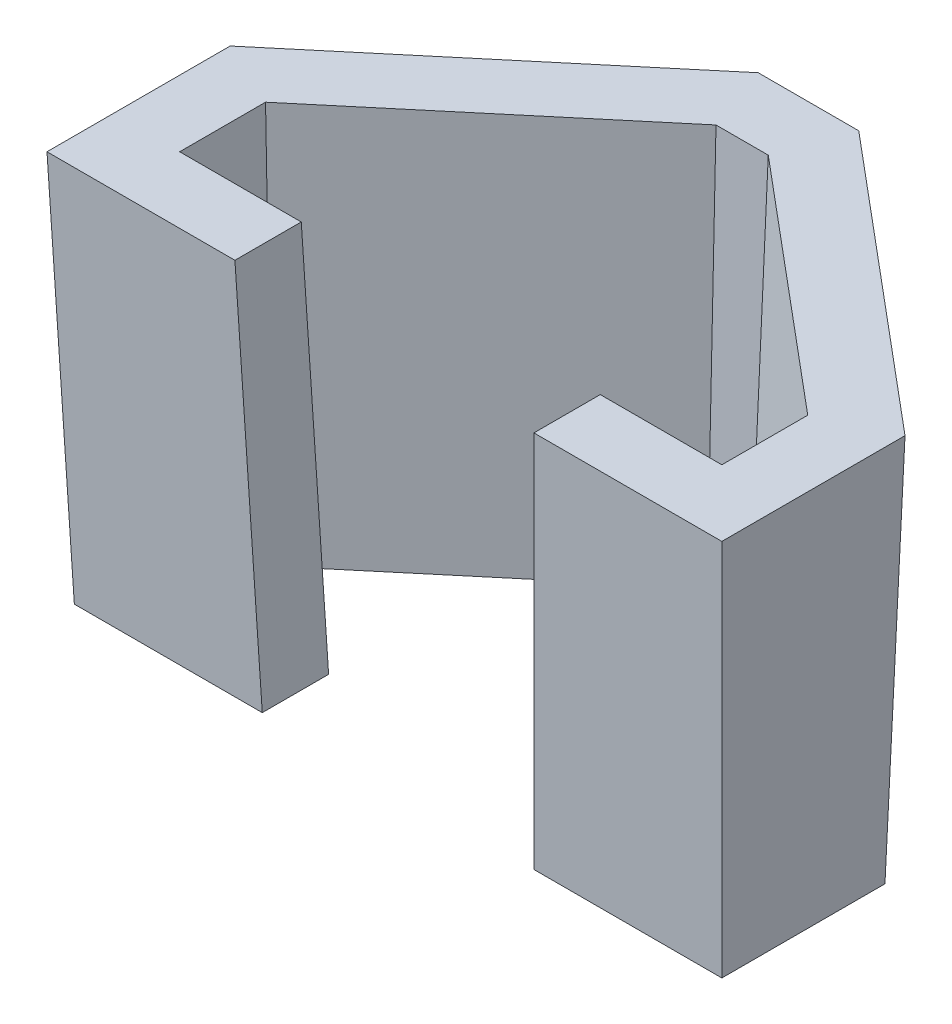
ISO-10303-21;
HEADER;
FILE_DESCRIPTION(('STEP AP214'),'2;1');
FILE_NAME('part.step','',(''),(''),'','','');
FILE_SCHEMA(('AUTOMOTIVE_DESIGN { 1 0 10303 214 1 1 1 1 }'));
ENDSEC;
DATA;
#1=APPLICATION_CONTEXT('core data for automotive mechanical design processes');
#2=APPLICATION_PROTOCOL_DEFINITION('international standard','automotive_design',2000,#1);
#3=PRODUCT_CONTEXT('',#1,'mechanical');
#4=PRODUCT('Part','Part','',(#3));
#5=PRODUCT_RELATED_PRODUCT_CATEGORY('part','',(#4));
#6=PRODUCT_DEFINITION_FORMATION('','',#4);
#7=PRODUCT_DEFINITION_CONTEXT('part definition',#1,'design');
#8=PRODUCT_DEFINITION('design','',#6,#7);
#9=PRODUCT_DEFINITION_SHAPE('','',#8);
#10=(LENGTH_UNIT() NAMED_UNIT(*) SI_UNIT(.MILLI.,.METRE.));
#11=(NAMED_UNIT(*) PLANE_ANGLE_UNIT() SI_UNIT($,.RADIAN.));
#12=(NAMED_UNIT(*) SI_UNIT($,.STERADIAN.) SOLID_ANGLE_UNIT());
#13=UNCERTAINTY_MEASURE_WITH_UNIT(LENGTH_MEASURE(1.E-05),#10,'distance_accuracy_value','');
#14=(GEOMETRIC_REPRESENTATION_CONTEXT(3) GLOBAL_UNCERTAINTY_ASSIGNED_CONTEXT((#13)) GLOBAL_UNIT_ASSIGNED_CONTEXT((#10,
#11,#12)) REPRESENTATION_CONTEXT('',''));
#15=CARTESIAN_POINT('',(0.,0.,0.));
#16=DIRECTION('',(0.,0.,1.));
#17=DIRECTION('',(1.,0.,0.));
#18=AXIS2_PLACEMENT_3D('',#15,#16,#17);
#19=CARTESIAN_POINT('',(111.25,0.,12.7));
#20=DIRECTION('',(0.,-0.034899496702501,0.999390827019096));
#21=DIRECTION('',(0.,-0.999390827019096,-0.034899496702501));
#22=AXIS2_PLACEMENT_3D('',#19,#20,#21);
#23=PLANE('',#22);
#24=DIRECTION('',(-0.0348782627423747,-0.998782765958718,-0.0348782627423747));
#25=VECTOR('',#24,1.);
#26=CARTESIAN_POINT('',(75.2595505362086,-0.442414758217532,12.6845505362085));
#27=LINE('',#26,#25);
#28=CARTESIAN_POINT('',(77.8940577118811,75.,15.3190577118811));
#29=VERTEX_POINT('',#28);
#30=CARTESIAN_POINT('',(75.275,0.,12.7));
#31=VERTEX_POINT('',#30);
#32=EDGE_CURVE('E161',#29,#31,#27,.T.);
#33=ORIENTED_EDGE('',*,*,#32,.T.);
#34=DIRECTION('',(-1.,0.,0.));
#35=VECTOR('',#34,1.);
#36=CARTESIAN_POINT('',(111.25,0.,12.7));
#37=LINE('',#36,#35);
#38=CARTESIAN_POINT('',(111.25,0.,12.7));
#39=VERTEX_POINT('',#38);
#40=EDGE_CURVE('E171',#39,#31,#37,.T.);
#41=ORIENTED_EDGE('',*,*,#40,.F.);
#42=DIRECTION('',(-0.0348782627423747,-0.998782765958718,-0.0348782627423747));
#43=VECTOR('',#42,1.);
#44=CARTESIAN_POINT('',(111.212017180763,-1.08768563205724,12.6620171807634));
#45=LINE('',#44,#43);
#46=CARTESIAN_POINT('',(113.869057711881,75.,15.3190577118811));
#47=VERTEX_POINT('',#46);
#48=EDGE_CURVE('E211',#47,#39,#45,.T.);
#49=ORIENTED_EDGE('',*,*,#48,.F.);
#50=DIRECTION('',(-1.,0.,0.));
#51=VECTOR('',#50,1.);
#52=CARTESIAN_POINT('',(0.,75.,15.3190577118811));
#53=LINE('',#52,#51);
#54=EDGE_CURVE('E174',#47,#29,#53,.T.);
#55=ORIENTED_EDGE('',*,*,#54,.T.);
#56=EDGE_LOOP('',(#33,#41,#49,#55));
#57=FACE_BOUND('',#56,.T.);
#58=ADVANCED_FACE('F47',(#57),#23,.T.);
#59=CARTESIAN_POINT('',(98.55,0.,0.));
#60=DIRECTION('',(0.,-0.034899496702501,0.999390827019096));
#61=DIRECTION('',(0.,-0.999390827019096,-0.0348994967025011));
#62=AXIS2_PLACEMENT_3D('',#59,#60,#61);
#63=PLANE('',#62);
#64=DIRECTION('',(-1.,0.,0.));
#65=VECTOR('',#64,1.);
#66=CARTESIAN_POINT('',(98.55,0.,0.));
#67=LINE('',#66,#65);
#68=CARTESIAN_POINT('',(98.55,0.,0.));
#69=VERTEX_POINT('',#68);
#70=CARTESIAN_POINT('',(75.275,0.,0.));
#71=VERTEX_POINT('',#70);
#72=EDGE_CURVE('E268',#69,#71,#67,.T.);
#73=ORIENTED_EDGE('',*,*,#72,.T.);
#74=DIRECTION('',(0.0348782627423747,0.998782765958718,0.0348782627423747));
#75=VECTOR('',#74,1.);
#76=CARTESIAN_POINT('',(75.3033138795076,0.810803425001026,0.0283138795075805));
#77=LINE('',#76,#75);
#78=CARTESIAN_POINT('',(77.8940577118811,75.,2.61905771188109));
#79=VERTEX_POINT('',#78);
#80=EDGE_CURVE('E11',#71,#79,#77,.T.);
#81=ORIENTED_EDGE('',*,*,#80,.T.);
#82=DIRECTION('',(-1.,0.,0.));
#83=VECTOR('',#82,1.);
#84=CARTESIAN_POINT('',(0.,75.,2.61905771188109));
#85=LINE('',#84,#83);
#86=CARTESIAN_POINT('',(101.169057711881,75.,2.61905771188109));
#87=VERTEX_POINT('',#86);
#88=EDGE_CURVE('E289',#87,#79,#85,.T.);
#89=ORIENTED_EDGE('',*,*,#88,.F.);
#90=DIRECTION('',(-0.0348782627423747,-0.998782765958718,-0.0348782627423747));
#91=VECTOR('',#90,1.);
#92=CARTESIAN_POINT('',(98.5346721855297,-0.438931177444165,-0.0153278144702715));
#93=LINE('',#92,#91);
#94=EDGE_CURVE('E283',#87,#69,#93,.T.);
#95=ORIENTED_EDGE('',*,*,#94,.T.);
#96=EDGE_LOOP('',(#73,#81,#89,#95));
#97=FACE_BOUND('',#96,.T.);
#98=ADVANCED_FACE('F347',(#97),#63,.F.);
#99=DIRECTION('',(0.0348782627423747,-0.998782765958718,-0.0348782627423747));
#100=VECTOR('',#99,1.);
#101=CARTESIAN_POINT('',(23.275,0.,12.7));
#102=LINE('',#101,#100);
#103=CARTESIAN_POINT('',(20.6559422881189,75.,15.3190577118811));
#104=VERTEX_POINT('',#103);
#105=CARTESIAN_POINT('',(23.275,0.,12.7));
#106=VERTEX_POINT('',#105);
#107=EDGE_CURVE('E176',#104,#106,#102,.T.);
#108=ORIENTED_EDGE('',*,*,#107,.F.);
#109=CARTESIAN_POINT('',(-15.3190577118811,75.,15.3190577118811));
#110=VERTEX_POINT('',#109);
#111=EDGE_CURVE('E210',#104,#110,#53,.T.);
#112=ORIENTED_EDGE('',*,*,#111,.T.);
#113=DIRECTION('',(0.0348782627423747,-0.998782765958718,-0.0348782627423747));
#114=VECTOR('',#113,1.);
#115=CARTESIAN_POINT('',(-12.5492156663818,-4.31789836858764,12.5492156663818));
#116=LINE('',#115,#114);
#117=CARTESIAN_POINT('',(-12.7,0.,12.7));
#118=VERTEX_POINT('',#117);
#119=EDGE_CURVE('E215',#110,#118,#116,.T.);
#120=ORIENTED_EDGE('',*,*,#119,.T.);
#121=EDGE_CURVE('E184',#106,#118,#37,.T.);
#122=ORIENTED_EDGE('',*,*,#121,.F.);
#123=EDGE_LOOP('',(#108,#112,#120,#122));
#124=FACE_BOUND('',#123,.T.);
#125=ADVANCED_FACE('F455',(#124),#23,.T.);
#126=CARTESIAN_POINT('',(111.25,0.,-18.5232068902524));
#127=DIRECTION('',(0.999390827019096,-0.034899496702501,0.));
#128=DIRECTION('',(0.0348994967025011,0.999390827019096,0.));
#129=AXIS2_PLACEMENT_3D('',#126,#127,#128);
#130=PLANE('',#129);
#131=DIRECTION('',(0.,0.,1.));
#132=VECTOR('',#131,1.);
#133=CARTESIAN_POINT('',(111.25,0.,-18.5232068902524));
#134=LINE('',#133,#132);
#135=CARTESIAN_POINT('',(111.25,0.,-18.5232068902524));
#136=VERTEX_POINT('',#135);
#137=EDGE_CURVE('E181',#136,#39,#134,.T.);
#138=ORIENTED_EDGE('',*,*,#137,.F.);
#139=DIRECTION('',(-0.0348948745148471,-0.999258464882715,0.0162747685953412));
#140=VECTOR('',#139,1.);
#141=CARTESIAN_POINT('',(111.210488163233,-1.13147096533441,-18.5047787970409));
#142=LINE('',#141,#140);
#143=CARTESIAN_POINT('',(113.869057711881,75.,-19.7447203300148));
#144=VERTEX_POINT('',#143);
#145=EDGE_CURVE('E214',#144,#136,#142,.T.);
#146=ORIENTED_EDGE('',*,*,#145,.F.);
#147=DIRECTION('',(0.,0.,1.));
#148=VECTOR('',#147,1.);
#149=CARTESIAN_POINT('',(113.869057711881,75.,0.));
#150=LINE('',#149,#148);
#151=EDGE_CURVE('E220',#144,#47,#150,.T.);
#152=ORIENTED_EDGE('',*,*,#151,.T.);
#153=ORIENTED_EDGE('',*,*,#48,.T.);
#154=EDGE_LOOP('',(#138,#146,#152,#153));
#155=FACE_BOUND('',#154,.T.);
#156=ADVANCED_FACE('F474',(#155),#130,.T.);
#157=CARTESIAN_POINT('',(57.9463991500488,0.,-63.2373203455384));
#158=DIRECTION('',(0.642287141369066,-0.034899496702501,-0.765669153852932));
#159=DIRECTION('',(-0.766135863120447,0.,-0.642678643834294));
#160=AXIS2_PLACEMENT_3D('',#157,#158,#159);
#161=PLANE('',#160);
#162=DIRECTION('',(0.766135863120447,0.,0.642678643834294));
#163=VECTOR('',#162,1.);
#164=CARTESIAN_POINT('',(57.9463991500488,0.,-63.2373203455384));
#165=LINE('',#164,#163);
#166=CARTESIAN_POINT('',(57.9463991500488,0.,-63.2373203455384));
#167=VERTEX_POINT('',#166);
#168=EDGE_CURVE('E205',#167,#136,#165,.T.);
#169=ORIENTED_EDGE('',*,*,#168,.F.);
#170=DIRECTION('',(-0.0126985433124823,-0.999310246384854,0.0348966827647472));
#171=VECTOR('',#170,1.);
#172=CARTESIAN_POINT('',(57.9436025717553,-0.220076372124338,-63.2296351092768));
#173=LINE('',#172,#171);
#174=CARTESIAN_POINT('',(58.899447266869,75.,-65.8563780574195));
#175=VERTEX_POINT('',#174);
#176=EDGE_CURVE('E226',#175,#167,#173,.T.);
#177=ORIENTED_EDGE('',*,*,#176,.F.);
#178=DIRECTION('',(0.766135863120447,0.,0.642678643834294));
#179=VECTOR('',#178,1.);
#180=CARTESIAN_POINT('',(56.7538905767994,75.,-67.6561938997784));
#181=LINE('',#180,#179);
#182=EDGE_CURVE('E237',#175,#144,#181,.T.);
#183=ORIENTED_EDGE('',*,*,#182,.T.);
#184=ORIENTED_EDGE('',*,*,#145,.T.);
#185=EDGE_LOOP('',(#169,#177,#183,#184));
#186=FACE_BOUND('',#185,.T.);
#187=ADVANCED_FACE('F471',(#186),#161,.T.);
#188=CARTESIAN_POINT('',(40.6036008499512,0.,-63.2373203455384));
#189=DIRECTION('',(0.,-0.034899496702501,-0.999390827019096));
#190=DIRECTION('',(0.,0.999390827019096,-0.034899496702501));
#191=AXIS2_PLACEMENT_3D('',#188,#189,#190);
#192=PLANE('',#191);
#193=DIRECTION('',(1.,0.,0.));
#194=VECTOR('',#193,1.);
#195=CARTESIAN_POINT('',(40.6036008499512,0.,-63.2373203455384));
#196=LINE('',#195,#194);
#197=CARTESIAN_POINT('',(40.6036008499512,0.,-63.2373203455384));
#198=VERTEX_POINT('',#197);
#199=EDGE_CURVE('E201',#198,#167,#196,.T.);
#200=ORIENTED_EDGE('',*,*,#199,.F.);
#201=DIRECTION('',(0.0126985433124823,-0.999310246384854,0.0348966827647472));
#202=VECTOR('',#201,1.);
#203=CARTESIAN_POINT('',(40.6148199640562,-0.882886753589432,-63.206489260729));
#204=LINE('',#203,#202);
#205=CARTESIAN_POINT('',(39.650552733131,75.,-65.8563780574195));
#206=VERTEX_POINT('',#205);
#207=EDGE_CURVE('E223',#206,#198,#204,.T.);
#208=ORIENTED_EDGE('',*,*,#207,.F.);
#209=DIRECTION('',(1.,0.,0.));
#210=VECTOR('',#209,1.);
#211=CARTESIAN_POINT('',(0.,75.,-65.8563780574194));
#212=LINE('',#211,#210);
#213=EDGE_CURVE('E241',#206,#175,#212,.T.);
#214=ORIENTED_EDGE('',*,*,#213,.T.);
#215=ORIENTED_EDGE('',*,*,#176,.T.);
#216=EDGE_LOOP('',(#200,#208,#214,#215));
#217=FACE_BOUND('',#216,.T.);
#218=ADVANCED_FACE('F469',(#217),#192,.T.);
#219=CARTESIAN_POINT('',(-12.7,0.,-18.5232068902524));
#220=DIRECTION('',(-0.642287141369066,-0.034899496702501,-0.765669153852932));
#221=DIRECTION('',(-0.766135863120447,0.,0.642678643834294));
#222=AXIS2_PLACEMENT_3D('',#219,#220,#221);
#223=PLANE('',#222);
#224=DIRECTION('',(0.766135863120447,0.,-0.642678643834294));
#225=VECTOR('',#224,1.);
#226=CARTESIAN_POINT('',(-12.7,0.,-18.5232068902524));
#227=LINE('',#226,#225);
#228=CARTESIAN_POINT('',(-12.7,0.,-18.5232068902524));
#229=VERTEX_POINT('',#228);
#230=EDGE_CURVE('E191',#229,#198,#227,.T.);
#231=ORIENTED_EDGE('',*,*,#230,.F.);
#232=DIRECTION('',(0.0348948745148471,-0.999258464882716,0.0162747685953412));
#233=VECTOR('',#232,1.);
#234=CARTESIAN_POINT('',(-12.6822681532213,-0.507773655527217,-18.5149368589912));
#235=LINE('',#234,#233);
#236=CARTESIAN_POINT('',(-15.3190577118811,75.,-19.7447203300148));
#237=VERTEX_POINT('',#236);
#238=EDGE_CURVE('E219',#237,#229,#235,.T.);
#239=ORIENTED_EDGE('',*,*,#238,.F.);
#240=DIRECTION('',(0.766135863120447,0.,-0.642678643834294));
#241=VECTOR('',#240,1.);
#242=CARTESIAN_POINT('',(-16.0492086196296,75.,-19.1322279278513));
#243=LINE('',#242,#241);
#244=EDGE_CURVE('E245',#237,#206,#243,.T.);
#245=ORIENTED_EDGE('',*,*,#244,.T.);
#246=ORIENTED_EDGE('',*,*,#207,.T.);
#247=EDGE_LOOP('',(#231,#239,#245,#246));
#248=FACE_BOUND('',#247,.T.);
#249=ADVANCED_FACE('F465',(#248),#223,.T.);
#250=CARTESIAN_POINT('',(-12.7,0.,12.7));
#251=DIRECTION('',(-0.999390827019096,-0.034899496702501,0.));
#252=DIRECTION('',(0.0348994967025011,-0.999390827019096,0.));
#253=AXIS2_PLACEMENT_3D('',#250,#251,#252);
#254=PLANE('',#253);
#255=DIRECTION('',(0.,0.,-1.));
#256=VECTOR('',#255,1.);
#257=CARTESIAN_POINT('',(-12.7,0.,12.7));
#258=LINE('',#257,#256);
#259=EDGE_CURVE('E183',#118,#229,#258,.T.);
#260=ORIENTED_EDGE('',*,*,#259,.F.);
#261=ORIENTED_EDGE('',*,*,#119,.F.);
#262=DIRECTION('',(0.,0.,-1.));
#263=VECTOR('',#262,1.);
#264=CARTESIAN_POINT('',(-15.3190577118811,75.,0.));
#265=LINE('',#264,#263);
#266=EDGE_CURVE('E233',#110,#237,#265,.T.);
#267=ORIENTED_EDGE('',*,*,#266,.T.);
#268=ORIENTED_EDGE('',*,*,#238,.T.);
#269=EDGE_LOOP('',(#260,#261,#267,#268));
#270=FACE_BOUND('',#269,.T.);
#271=ADVANCED_FACE('F459',(#270),#254,.T.);
#272=CARTESIAN_POINT('',(0.,75.,0.));
#273=DIRECTION('',(0.,-1.,0.));
#274=DIRECTION('',(0.,0.,-1.));
#275=AXIS2_PLACEMENT_3D('',#272,#273,#274);
#276=PLANE('',#275);
#277=ORIENTED_EDGE('',*,*,#88,.T.);
#278=DIRECTION('',(0.,0.,1.));
#279=VECTOR('',#278,1.);
#280=CARTESIAN_POINT('',(77.8940577118811,75.,0.));
#281=LINE('',#280,#279);
#282=EDGE_CURVE('E63',#79,#29,#281,.T.);
#283=ORIENTED_EDGE('',*,*,#282,.T.);
#284=ORIENTED_EDGE('',*,*,#54,.F.);
#285=ORIENTED_EDGE('',*,*,#151,.F.);
#286=ORIENTED_EDGE('',*,*,#182,.F.);
#287=ORIENTED_EDGE('',*,*,#213,.F.);
#288=ORIENTED_EDGE('',*,*,#244,.F.);
#289=ORIENTED_EDGE('',*,*,#266,.F.);
#290=ORIENTED_EDGE('',*,*,#111,.F.);
#291=DIRECTION('',(0.,0.,-1.));
#292=VECTOR('',#291,1.);
#293=CARTESIAN_POINT('',(20.6559422881189,75.,0.));
#294=LINE('',#293,#292);
#295=CARTESIAN_POINT('',(20.6559422881189,75.,2.61905771188108));
#296=VERTEX_POINT('',#295);
#297=EDGE_CURVE('E177',#104,#296,#294,.T.);
#298=ORIENTED_EDGE('',*,*,#297,.T.);
#299=CARTESIAN_POINT('',(-2.61905771188109,75.,2.61905771188109));
#300=VERTEX_POINT('',#299);
#301=EDGE_CURVE('E261',#296,#300,#85,.T.);
#302=ORIENTED_EDGE('',*,*,#301,.T.);
#303=DIRECTION('',(0.,0.,-1.));
#304=VECTOR('',#303,1.);
#305=CARTESIAN_POINT('',(-2.61905771188108,75.,0.));
#306=LINE('',#305,#304);
#307=CARTESIAN_POINT('',(-2.61905771188108,75.,-13.8215134397624));
#308=VERTEX_POINT('',#307);
#309=EDGE_CURVE('E275',#300,#308,#306,.T.);
#310=ORIENTED_EDGE('',*,*,#309,.T.);
#311=DIRECTION('',(0.766135863120447,0.,-0.642678643834294));
#312=VECTOR('',#311,1.);
#313=CARTESIAN_POINT('',(-7.88718984293411,75.,-9.40230246622162));
#314=LINE('',#313,#312);
#315=CARTESIAN_POINT('',(44.2719518831798,75.,-53.1563780574195));
#316=VERTEX_POINT('',#315);
#317=EDGE_CURVE('E195',#308,#316,#314,.T.);
#318=ORIENTED_EDGE('',*,*,#317,.T.);
#319=DIRECTION('',(1.,0.,0.));
#320=VECTOR('',#319,1.);
#321=CARTESIAN_POINT('',(0.,75.,-53.1563780574195));
#322=LINE('',#321,#320);
#323=CARTESIAN_POINT('',(54.2780481168202,75.,-53.1563780574195));
#324=VERTEX_POINT('',#323);
#325=EDGE_CURVE('E313',#316,#324,#322,.T.);
#326=ORIENTED_EDGE('',*,*,#325,.T.);
#327=DIRECTION('',(0.766135863120447,0.,0.642678643834294));
#328=VECTOR('',#327,1.);
#329=CARTESIAN_POINT('',(48.5918718001039,75.,-57.9262684381487));
#330=LINE('',#329,#328);
#331=CARTESIAN_POINT('',(101.169057711881,75.,-13.8215134397624));
#332=VERTEX_POINT('',#331);
#333=EDGE_CURVE('E310',#324,#332,#330,.T.);
#334=ORIENTED_EDGE('',*,*,#333,.T.);
#335=DIRECTION('',(0.,0.,1.));
#336=VECTOR('',#335,1.);
#337=CARTESIAN_POINT('',(101.169057711881,75.,0.));
#338=LINE('',#337,#336);
#339=EDGE_CURVE('E306',#332,#87,#338,.T.);
#340=ORIENTED_EDGE('',*,*,#339,.T.);
#341=EDGE_LOOP('',(#277,#283,#284,#285,#286,#287,#288,#289,#290,#298,#302,#310,#318,#326,#334,#340));
#342=FACE_BOUND('',#341,.T.);
#343=ADVANCED_FACE('F324',(#342),#276,.F.);
#344=CARTESIAN_POINT('',(0.,0.,0.));
#345=DIRECTION('',(0.,1.,0.));
#346=DIRECTION('',(0.,0.,1.));
#347=AXIS2_PLACEMENT_3D('',#344,#345,#346);
#348=PLANE('',#347);
#349=ORIENTED_EDGE('',*,*,#40,.T.);
#350=DIRECTION('',(0.,0.,1.));
#351=VECTOR('',#350,1.);
#352=CARTESIAN_POINT('',(75.275,0.,0.));
#353=LINE('',#352,#351);
#354=EDGE_CURVE('E158',#71,#31,#353,.T.);
#355=ORIENTED_EDGE('',*,*,#354,.F.);
#356=ORIENTED_EDGE('',*,*,#72,.F.);
#357=DIRECTION('',(0.,0.,1.));
#358=VECTOR('',#357,1.);
#359=CARTESIAN_POINT('',(98.55,0.,-12.6));
#360=LINE('',#359,#358);
#361=CARTESIAN_POINT('',(98.55,0.,-12.6));
#362=VERTEX_POINT('',#361);
#363=EDGE_CURVE('E269',#362,#69,#360,.T.);
#364=ORIENTED_EDGE('',*,*,#363,.F.);
#365=DIRECTION('',(0.766135863120447,0.,0.642678643834294));
#366=VECTOR('',#365,1.);
#367=CARTESIAN_POINT('',(53.325,0.,-50.5373203455384));
#368=LINE('',#367,#366);
#369=CARTESIAN_POINT('',(53.325,0.,-50.5373203455384));
#370=VERTEX_POINT('',#369);
#371=EDGE_CURVE('E277',#370,#362,#368,.T.);
#372=ORIENTED_EDGE('',*,*,#371,.F.);
#373=DIRECTION('',(1.,0.,0.));
#374=VECTOR('',#373,1.);
#375=CARTESIAN_POINT('',(45.225,0.,-50.5373203455384));
#376=LINE('',#375,#374);
#377=CARTESIAN_POINT('',(45.225,0.,-50.5373203455384));
#378=VERTEX_POINT('',#377);
#379=EDGE_CURVE('E335',#378,#370,#376,.T.);
#380=ORIENTED_EDGE('',*,*,#379,.F.);
#381=DIRECTION('',(0.766135863120447,0.,-0.642678643834294));
#382=VECTOR('',#381,1.);
#383=CARTESIAN_POINT('',(0.,0.,-12.6));
#384=LINE('',#383,#382);
#385=CARTESIAN_POINT('',(0.,0.,-12.6));
#386=VERTEX_POINT('',#385);
#387=EDGE_CURVE('E330',#386,#378,#384,.T.);
#388=ORIENTED_EDGE('',*,*,#387,.F.);
#389=DIRECTION('',(0.,0.,-1.));
#390=VECTOR('',#389,1.);
#391=CARTESIAN_POINT('',(0.,0.,0.));
#392=LINE('',#391,#390);
#393=CARTESIAN_POINT('',(0.,0.,0.));
#394=VERTEX_POINT('',#393);
#395=EDGE_CURVE('E266',#394,#386,#392,.T.);
#396=ORIENTED_EDGE('',*,*,#395,.F.);
#397=CARTESIAN_POINT('',(23.275,0.,0.));
#398=VERTEX_POINT('',#397);
#399=EDGE_CURVE('E259',#398,#394,#67,.T.);
#400=ORIENTED_EDGE('',*,*,#399,.F.);
#401=DIRECTION('',(0.,0.,-1.));
#402=VECTOR('',#401,1.);
#403=CARTESIAN_POINT('',(23.275,0.,0.));
#404=LINE('',#403,#402);
#405=EDGE_CURVE('E70',#106,#398,#404,.T.);
#406=ORIENTED_EDGE('',*,*,#405,.F.);
#407=ORIENTED_EDGE('',*,*,#121,.T.);
#408=ORIENTED_EDGE('',*,*,#259,.T.);
#409=ORIENTED_EDGE('',*,*,#230,.T.);
#410=ORIENTED_EDGE('',*,*,#199,.T.);
#411=ORIENTED_EDGE('',*,*,#168,.T.);
#412=ORIENTED_EDGE('',*,*,#137,.T.);
#413=EDGE_LOOP('',(#349,#355,#356,#364,#372,#380,#388,#396,#400,#406,#407,#408,#409,#410,#411,#412));
#414=FACE_BOUND('',#413,.T.);
#415=ADVANCED_FACE('F49',(#414),#348,.F.);
#416=CARTESIAN_POINT('',(0.,0.,0.));
#417=DIRECTION('',(-0.999390827019096,-0.034899496702501,0.));
#418=DIRECTION('',(0.034899496702501,-0.999390827019096,0.));
#419=AXIS2_PLACEMENT_3D('',#416,#417,#418);
#420=PLANE('',#419);
#421=ORIENTED_EDGE('',*,*,#395,.T.);
#422=DIRECTION('',(0.0348948745148471,-0.999258464882715,0.0162747685953412));
#423=VECTOR('',#422,1.);
#424=CARTESIAN_POINT('',(0.0071556156994482,-0.204910023564566,-12.5966626620303));
#425=LINE('',#424,#423);
#426=EDGE_CURVE('E284',#308,#386,#425,.T.);
#427=ORIENTED_EDGE('',*,*,#426,.F.);
#428=ORIENTED_EDGE('',*,*,#309,.F.);
#429=DIRECTION('',(0.0348782627423747,-0.998782765958718,-0.0348782627423747));
#430=VECTOR('',#429,1.);
#431=CARTESIAN_POINT('',(0.119885406035317,-3.43306885215258,-0.119885406035319));
#432=LINE('',#431,#430);
#433=EDGE_CURVE('E193',#300,#394,#432,.T.);
#434=ORIENTED_EDGE('',*,*,#433,.T.);
#435=EDGE_LOOP('',(#421,#427,#428,#434));
#436=FACE_BOUND('',#435,.T.);
#437=ADVANCED_FACE('F519',(#436),#420,.F.);
#438=ORIENTED_EDGE('',*,*,#301,.F.);
#439=DIRECTION('',(0.0348782627423747,-0.998782765958718,-0.0348782627423747));
#440=VECTOR('',#439,1.);
#441=CARTESIAN_POINT('',(23.3665715265278,-2.62226542715155,-0.0915715265277389));
#442=LINE('',#441,#440);
#443=EDGE_CURVE('E56',#296,#398,#442,.T.);
#444=ORIENTED_EDGE('',*,*,#443,.T.);
#445=ORIENTED_EDGE('',*,*,#399,.T.);
#446=ORIENTED_EDGE('',*,*,#433,.F.);
#447=EDGE_LOOP('',(#438,#444,#445,#446));
#448=FACE_BOUND('',#447,.T.);
#449=ADVANCED_FACE('F257',(#448),#63,.F.);
#450=CARTESIAN_POINT('',(98.55,0.,-12.6));
#451=DIRECTION('',(0.999390827019096,-0.034899496702501,0.));
#452=DIRECTION('',(0.034899496702501,0.999390827019096,0.));
#453=AXIS2_PLACEMENT_3D('',#450,#451,#452);
#454=PLANE('',#453);
#455=ORIENTED_EDGE('',*,*,#363,.T.);
#456=ORIENTED_EDGE('',*,*,#94,.F.);
#457=ORIENTED_EDGE('',*,*,#339,.F.);
#458=DIRECTION('',(-0.0348948745148471,-0.999258464882716,0.0162747685953412));
#459=VECTOR('',#458,1.);
#460=CARTESIAN_POINT('',(98.5164765083541,-0.959987197699711,-12.5843648364801));
#461=LINE('',#460,#459);
#462=EDGE_CURVE('E295',#332,#362,#461,.T.);
#463=ORIENTED_EDGE('',*,*,#462,.T.);
#464=EDGE_LOOP('',(#455,#456,#457,#463));
#465=FACE_BOUND('',#464,.T.);
#466=ADVANCED_FACE('F344',(#465),#454,.F.);
#467=CARTESIAN_POINT('',(53.325,0.,-50.5373203455384));
#468=DIRECTION('',(0.642287141369066,-0.034899496702501,-0.765669153852933));
#469=DIRECTION('',(-0.766135863120447,0.,-0.642678643834294));
#470=AXIS2_PLACEMENT_3D('',#467,#468,#469);
#471=PLANE('',#470);
#472=ORIENTED_EDGE('',*,*,#371,.T.);
#473=ORIENTED_EDGE('',*,*,#462,.F.);
#474=ORIENTED_EDGE('',*,*,#333,.F.);
#475=DIRECTION('',(-0.0126985433124823,-0.999310246384854,0.0348966827647472));
#476=VECTOR('',#475,1.);
#477=CARTESIAN_POINT('',(53.3236938506817,-0.102787254015236,-50.5337309355342));
#478=LINE('',#477,#476);
#479=EDGE_CURVE('E292',#324,#370,#478,.T.);
#480=ORIENTED_EDGE('',*,*,#479,.T.);
#481=EDGE_LOOP('',(#472,#473,#474,#480));
#482=FACE_BOUND('',#481,.T.);
#483=ADVANCED_FACE('F340',(#482),#471,.F.);
#484=CARTESIAN_POINT('',(45.225,0.,-50.5373203455384));
#485=DIRECTION('',(0.,-0.034899496702501,-0.999390827019096));
#486=DIRECTION('',(0.,0.999390827019096,-0.034899496702501));
#487=AXIS2_PLACEMENT_3D('',#484,#485,#486);
#488=PLANE('',#487);
#489=ORIENTED_EDGE('',*,*,#379,.T.);
#490=ORIENTED_EDGE('',*,*,#479,.F.);
#491=ORIENTED_EDGE('',*,*,#325,.F.);
#492=DIRECTION('',(0.0126985433124823,-0.999310246384854,0.0348966827647472));
#493=VECTOR('',#492,1.);
#494=CARTESIAN_POINT('',(45.2345187647233,-0.74907797586659,-50.5111619662118));
#495=LINE('',#494,#493);
#496=EDGE_CURVE('E288',#316,#378,#495,.T.);
#497=ORIENTED_EDGE('',*,*,#496,.T.);
#498=EDGE_LOOP('',(#489,#490,#491,#497));
#499=FACE_BOUND('',#498,.T.);
#500=ADVANCED_FACE('F334',(#499),#488,.F.);
#501=CARTESIAN_POINT('',(0.,0.,-12.6));
#502=DIRECTION('',(-0.642287141369066,-0.034899496702501,-0.765669153852933));
#503=DIRECTION('',(-0.766135863120447,0.,0.642678643834294));
#504=AXIS2_PLACEMENT_3D('',#501,#502,#503);
#505=PLANE('',#504);
#506=ORIENTED_EDGE('',*,*,#387,.T.);
#507=ORIENTED_EDGE('',*,*,#496,.F.);
#508=ORIENTED_EDGE('',*,*,#317,.F.);
#509=ORIENTED_EDGE('',*,*,#426,.T.);
#510=EDGE_LOOP('',(#506,#507,#508,#509));
#511=FACE_BOUND('',#510,.T.);
#512=ADVANCED_FACE('F329',(#511),#505,.F.);
#513=CARTESIAN_POINT('',(23.275,0.,0.));
#514=DIRECTION('',(-0.999390827019096,-0.034899496702501,0.));
#515=DIRECTION('',(0.034899496702501,-0.999390827019096,0.));
#516=AXIS2_PLACEMENT_3D('',#513,#514,#515);
#517=PLANE('',#516);
#518=ORIENTED_EDGE('',*,*,#297,.F.);
#519=ORIENTED_EDGE('',*,*,#107,.T.);
#520=ORIENTED_EDGE('',*,*,#405,.T.);
#521=ORIENTED_EDGE('',*,*,#443,.F.);
#522=EDGE_LOOP('',(#518,#519,#520,#521));
#523=FACE_BOUND('',#522,.T.);
#524=ADVANCED_FACE('F555',(#523),#517,.F.);
#525=CARTESIAN_POINT('',(75.275,0.,0.));
#526=DIRECTION('',(0.999390827019096,-0.034899496702501,0.));
#527=DIRECTION('',(0.034899496702501,0.999390827019096,0.));
#528=AXIS2_PLACEMENT_3D('',#525,#526,#527);
#529=PLANE('',#528);
#530=ORIENTED_EDGE('',*,*,#354,.T.);
#531=ORIENTED_EDGE('',*,*,#32,.F.);
#532=ORIENTED_EDGE('',*,*,#282,.F.);
#533=ORIENTED_EDGE('',*,*,#80,.F.);
#534=EDGE_LOOP('',(#530,#531,#532,#533));
#535=FACE_BOUND('',#534,.T.);
#536=ADVANCED_FACE('F160',(#535),#529,.F.);
#537=CLOSED_SHELL('',(#58,#98,#125,#156,#187,#218,#249,#271,#343,#415,#437,#449,#466,#483,#500,
#512,#524,#536));
#538=MANIFOLD_SOLID_BREP('B2',#537);
#539=ADVANCED_BREP_SHAPE_REPRESENTATION('',(#18,#538),#14);
#540=SHAPE_DEFINITION_REPRESENTATION(#9,#539);
ENDSEC;
END-ISO-10303-21;
